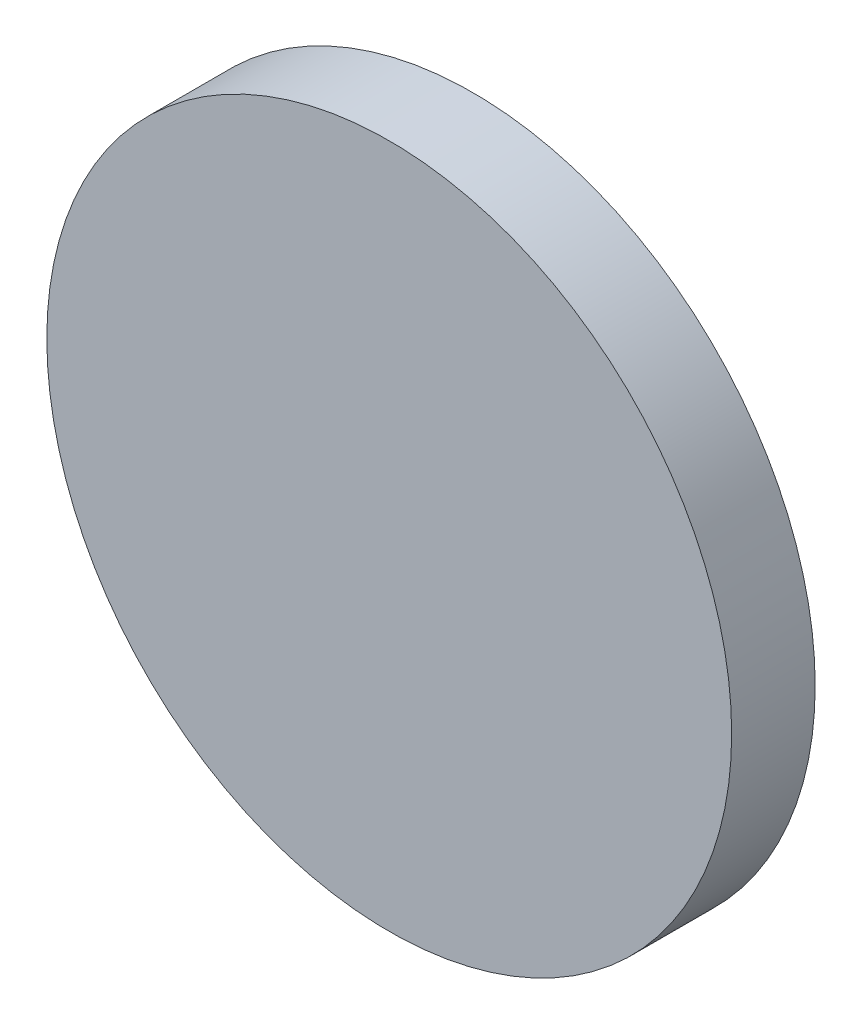
ISO-10303-21;
HEADER;
FILE_DESCRIPTION(('STEP AP214'),'2;1');
FILE_NAME('part.step','',(''),(''),'','','');
FILE_SCHEMA(('AUTOMOTIVE_DESIGN { 1 0 10303 214 1 1 1 1 }'));
ENDSEC;
DATA;
#1=APPLICATION_CONTEXT('core data for automotive mechanical design processes');
#2=APPLICATION_PROTOCOL_DEFINITION('international standard','automotive_design',2000,#1);
#3=PRODUCT_CONTEXT('',#1,'mechanical');
#4=PRODUCT('Part','Part','',(#3));
#5=PRODUCT_RELATED_PRODUCT_CATEGORY('part','',(#4));
#6=PRODUCT_DEFINITION_FORMATION('','',#4);
#7=PRODUCT_DEFINITION_CONTEXT('part definition',#1,'design');
#8=PRODUCT_DEFINITION('design','',#6,#7);
#9=PRODUCT_DEFINITION_SHAPE('','',#8);
#10=(LENGTH_UNIT() NAMED_UNIT(*) SI_UNIT(.MILLI.,.METRE.));
#11=(NAMED_UNIT(*) PLANE_ANGLE_UNIT() SI_UNIT($,.RADIAN.));
#12=(NAMED_UNIT(*) SI_UNIT($,.STERADIAN.) SOLID_ANGLE_UNIT());
#13=UNCERTAINTY_MEASURE_WITH_UNIT(LENGTH_MEASURE(1.E-05),#10,'distance_accuracy_value','');
#14=(GEOMETRIC_REPRESENTATION_CONTEXT(3) GLOBAL_UNCERTAINTY_ASSIGNED_CONTEXT((#13)) GLOBAL_UNIT_ASSIGNED_CONTEXT((#10,
#11,#12)) REPRESENTATION_CONTEXT('',''));
#15=CARTESIAN_POINT('',(0.,0.,0.));
#16=DIRECTION('',(0.,0.,1.));
#17=DIRECTION('',(1.,0.,0.));
#18=AXIS2_PLACEMENT_3D('',#15,#16,#17);
#19=CARTESIAN_POINT('',(0.,0.,5.));
#20=DIRECTION('',(0.,0.,-1.));
#21=DIRECTION('',(-1.,0.,0.));
#22=AXIS2_PLACEMENT_3D('',#19,#20,#21);
#23=CYLINDRICAL_SURFACE('',#22,20.5);
#24=CARTESIAN_POINT('',(0.,0.,5.));
#25=DIRECTION('',(0.,0.,1.));
#26=DIRECTION('',(1.,0.,0.));
#27=AXIS2_PLACEMENT_3D('',#24,#25,#26);
#28=CIRCLE('',#27,20.5);
#29=CARTESIAN_POINT('',(20.5,0.,5.));
#30=VERTEX_POINT('',#29);
#31=EDGE_CURVE('E10',#30,#30,#28,.T.);
#32=ORIENTED_EDGE('',*,*,#31,.F.);
#33=EDGE_LOOP('',(#32));
#34=FACE_BOUND('',#33,.T.);
#35=CARTESIAN_POINT('',(0.,0.,0.));
#36=DIRECTION('',(0.,0.,1.));
#37=DIRECTION('',(1.,0.,0.));
#38=AXIS2_PLACEMENT_3D('',#35,#36,#37);
#39=CIRCLE('',#38,20.5);
#40=CARTESIAN_POINT('',(20.5,0.,0.));
#41=VERTEX_POINT('',#40);
#42=EDGE_CURVE('E34',#41,#41,#39,.T.);
#43=ORIENTED_EDGE('',*,*,#42,.T.);
#44=EDGE_LOOP('',(#43));
#45=FACE_BOUND('',#44,.T.);
#46=ADVANCED_FACE('F28',(#34,#45),#23,.T.);
#47=CARTESIAN_POINT('',(0.,0.,5.));
#48=DIRECTION('',(0.,0.,1.));
#49=DIRECTION('',(1.,0.,0.));
#50=AXIS2_PLACEMENT_3D('',#47,#48,#49);
#51=PLANE('',#50);
#52=ORIENTED_EDGE('',*,*,#31,.T.);
#53=EDGE_LOOP('',(#52));
#54=FACE_BOUND('',#53,.T.);
#55=ADVANCED_FACE('F43',(#54),#51,.T.);
#56=CARTESIAN_POINT('',(0.,0.,0.));
#57=DIRECTION('',(0.,0.,1.));
#58=DIRECTION('',(1.,0.,0.));
#59=AXIS2_PLACEMENT_3D('',#56,#57,#58);
#60=PLANE('',#59);
#61=ORIENTED_EDGE('',*,*,#42,.F.);
#62=EDGE_LOOP('',(#61));
#63=FACE_BOUND('',#62,.T.);
#64=ADVANCED_FACE('F41',(#63),#60,.F.);
#65=CLOSED_SHELL('',(#46,#55,#64));
#66=MANIFOLD_SOLID_BREP('B2',#65);
#67=ADVANCED_BREP_SHAPE_REPRESENTATION('',(#18,#66),#14);
#68=SHAPE_DEFINITION_REPRESENTATION(#9,#67);
ENDSEC;
END-ISO-10303-21;
